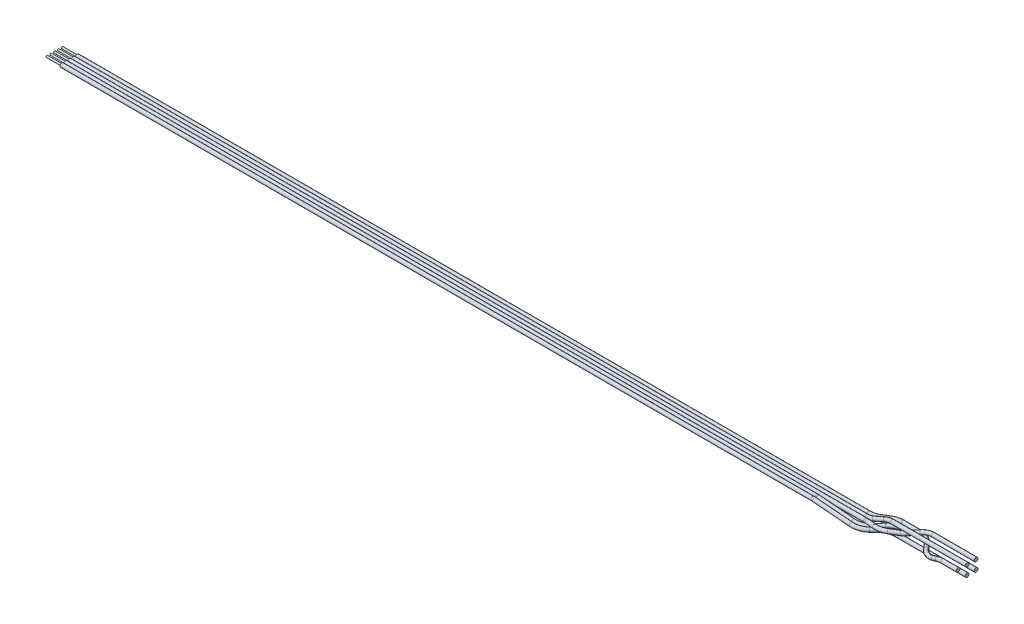
ISO-10303-21;
HEADER;
FILE_DESCRIPTION(('STEP AP214'),'2;1');
FILE_NAME('part.step','',(''),(''),'','','');
FILE_SCHEMA(('AUTOMOTIVE_DESIGN { 1 0 10303 214 1 1 1 1 }'));
ENDSEC;
DATA;
#1=APPLICATION_CONTEXT('core data for automotive mechanical design processes');
#2=APPLICATION_PROTOCOL_DEFINITION('international standard','automotive_design',2000,#1);
#3=PRODUCT_CONTEXT('',#1,'mechanical');
#4=PRODUCT('Part','Part','',(#3));
#5=PRODUCT_RELATED_PRODUCT_CATEGORY('part','',(#4));
#6=PRODUCT_DEFINITION_FORMATION('','',#4);
#7=PRODUCT_DEFINITION_CONTEXT('part definition',#1,'design');
#8=PRODUCT_DEFINITION('design','',#6,#7);
#9=PRODUCT_DEFINITION_SHAPE('','',#8);
#10=(LENGTH_UNIT() NAMED_UNIT(*) SI_UNIT(.MILLI.,.METRE.));
#11=(NAMED_UNIT(*) PLANE_ANGLE_UNIT() SI_UNIT($,.RADIAN.));
#12=(NAMED_UNIT(*) SI_UNIT($,.STERADIAN.) SOLID_ANGLE_UNIT());
#13=UNCERTAINTY_MEASURE_WITH_UNIT(LENGTH_MEASURE(1.E-05),#10,'distance_accuracy_value','');
#14=(GEOMETRIC_REPRESENTATION_CONTEXT(3) GLOBAL_UNCERTAINTY_ASSIGNED_CONTEXT((#13)) GLOBAL_UNIT_ASSIGNED_CONTEXT((#10,
#11,#12)) REPRESENTATION_CONTEXT('',''));
#15=CARTESIAN_POINT('',(0.,0.,0.));
#16=DIRECTION('',(0.,0.,1.));
#17=DIRECTION('',(1.,0.,0.));
#18=AXIS2_PLACEMENT_3D('',#15,#16,#17);
#19=CARTESIAN_POINT('',(296.,1.5,14.43));
#20=DIRECTION('',(1.,0.,0.));
#21=DIRECTION('',(0.,0.,-1.));
#22=AXIS2_PLACEMENT_3D('',#19,#20,#21);
#23=PLANE('',#22);
#24=CARTESIAN_POINT('',(296.,1.5,14.43));
#25=DIRECTION('',(1.,0.,0.));
#26=DIRECTION('',(0.,0.,-1.));
#27=AXIS2_PLACEMENT_3D('',#24,#25,#26);
#28=CIRCLE('',#27,0.6325);
#29=CARTESIAN_POINT('',(296.,1.5,13.7975));
#30=VERTEX_POINT('',#29);
#31=EDGE_CURVE('P0_E17',#30,#30,#28,.F.);
#32=ORIENTED_EDGE('',*,*,#31,.F.);
#33=EDGE_LOOP('',(#32));
#34=FACE_BOUND('',#33,.T.);
#35=ADVANCED_FACE('P0_F14',(#34),#23,.T.);
#36=CARTESIAN_POINT('',(290.8806130178,1.5,14.43));
#37=DIRECTION('',(1.,0.,0.));
#38=DIRECTION('',(0.,0.,-1.));
#39=AXIS2_PLACEMENT_3D('',#36,#37,#38);
#40=CYLINDRICAL_SURFACE('',#39,0.6325);
#41=ORIENTED_EDGE('',*,*,#31,.T.);
#42=EDGE_LOOP('',(#41));
#43=FACE_BOUND('',#42,.T.);
#44=CARTESIAN_POINT('',(290.8806130178,1.5,14.43));
#45=DIRECTION('',(1.,0.,0.));
#46=DIRECTION('',(0.,1.,0.));
#47=AXIS2_PLACEMENT_3D('',#44,#45,#46);
#48=CIRCLE('',#47,0.6325);
#49=CARTESIAN_POINT('',(290.8806130178,2.1325,14.43));
#50=VERTEX_POINT('',#49);
#51=EDGE_CURVE('P0_E29',#50,#50,#48,.F.);
#52=ORIENTED_EDGE('',*,*,#51,.F.);
#53=EDGE_LOOP('',(#52));
#54=FACE_BOUND('',#53,.T.);
#55=ADVANCED_FACE('P0_F94',(#43,#54),#40,.T.);
#56=CARTESIAN_POINT('',(290.8806130178,-4.5,14.43));
#57=DIRECTION('',(0.,0.,-1.));
#58=DIRECTION('',(0.28734788556629,-0.957826285221168,0.));
#59=AXIS2_PLACEMENT_3D('',#56,#57,#58);
#60=TOROIDAL_SURFACE('',#59,6.,0.6325);
#61=ORIENTED_EDGE('',*,*,#51,.T.);
#62=EDGE_LOOP('',(#61));
#63=FACE_BOUND('',#62,.T.);
#64=CARTESIAN_POINT('',(289.156525704404,1.24695771132738,14.43));
#65=DIRECTION('',(0.957826285221168,0.28734788556629,0.));
#66=DIRECTION('',(-0.28734788556629,0.957826285221168,0.));
#67=AXIS2_PLACEMENT_3D('',#64,#65,#66);
#68=CIRCLE('',#67,0.6325);
#69=CARTESIAN_POINT('',(288.974778166783,1.85278283672976,14.43));
#70=VERTEX_POINT('',#69);
#71=EDGE_CURVE('P0_E97',#70,#70,#68,.F.);
#72=ORIENTED_EDGE('',*,*,#71,.F.);
#73=EDGE_LOOP('',(#72));
#74=FACE_BOUND('',#73,.T.);
#75=ADVANCED_FACE('P0_F91',(#63,#74),#60,.T.);
#76=CARTESIAN_POINT('',(287.814150096,0.8442450288062,14.43));
#77=DIRECTION('',(0.957826285221168,0.28734788556629,0.));
#78=DIRECTION('',(-0.28734788556629,0.957826285221168,0.));
#79=AXIS2_PLACEMENT_3D('',#76,#77,#78);
#80=CYLINDRICAL_SURFACE('',#79,0.6325);
#81=ORIENTED_EDGE('',*,*,#71,.T.);
#82=EDGE_LOOP('',(#81));
#83=FACE_BOUND('',#82,.T.);
#84=CARTESIAN_POINT('',(287.814150096004,0.844245028791019,14.4300000000002));
#85=DIRECTION('',(0.95782628522173,0.287347885564419,8.44208036809846E-12));
#86=DIRECTION('',(0.0669156263339376,-0.223052087810011,0.972507102840865));
#87=AXIS2_PLACEMENT_3D('',#84,#85,#86);
#88=CIRCLE('',#87,0.6325);
#89=CARTESIAN_POINT('',(287.85647422966,0.703164583251187,15.045110742547));
#90=VERTEX_POINT('',#89);
#91=EDGE_CURVE('P0_E80',#90,#90,#88,.F.);
#92=ORIENTED_EDGE('',*,*,#91,.F.);
#93=EDGE_LOOP('',(#92));
#94=FACE_BOUND('',#93,.T.);
#95=ADVANCED_FACE('P0_F87',(#83,#94),#80,.T.);
#96=CARTESIAN_POINT('',(287.412656338,2.182557555651,8.594957382955));
#97=DIRECTION('',(-0.279447859699584,0.931492865665248,0.232873216416287));
#98=DIRECTION('',(0.715592641197166,0.36375959260856,-0.596327200997673));
#99=AXIS2_PLACEMENT_3D('',#96,#97,#98);
#100=TOROIDAL_SURFACE('',#99,6.,0.6325);
#101=ORIENTED_EDGE('',*,*,#91,.T.);
#102=EDGE_LOOP('',(#101));
#103=FACE_BOUND('',#102,.T.);
#104=CARTESIAN_POINT('',(283.119100490785,0.,12.1729205889123));
#105=DIRECTION('',(0.64018439966448,0.,0.768221279597376));
#106=DIRECTION('',(0.768221279597376,0.,-0.64018439966448));
#107=AXIS2_PLACEMENT_3D('',#104,#105,#106);
#108=CIRCLE('',#107,0.6325);
#109=CARTESIAN_POINT('',(283.605000450131,0.,11.7680039561245));
#110=VERTEX_POINT('',#109);
#111=EDGE_CURVE('P0_E77',#110,#110,#108,.F.);
#112=ORIENTED_EDGE('',*,*,#111,.F.);
#113=EDGE_LOOP('',(#112));
#114=FACE_BOUND('',#113,.T.);
#115=ADVANCED_FACE('P0_F84',(#103,#114),#100,.T.);
#116=CARTESIAN_POINT('',(281.7990780017,0.,10.58889360201));
#117=DIRECTION('',(0.64018439966448,0.,0.768221279597376));
#118=DIRECTION('',(0.768221279597376,0.,-0.64018439966448));
#119=AXIS2_PLACEMENT_3D('',#116,#117,#118);
#120=CYLINDRICAL_SURFACE('',#119,0.6325);
#121=ORIENTED_EDGE('',*,*,#111,.T.);
#122=EDGE_LOOP('',(#121));
#123=FACE_BOUND('',#122,.T.);
#124=CARTESIAN_POINT('',(281.799078001675,0.,10.5888936020025));
#125=DIRECTION('',(0.640184399666259,0.,0.768221279595894));
#126=DIRECTION('',(0.768221279595894,0.,-0.640184399666259));
#127=AXIS2_PLACEMENT_3D('',#124,#125,#126);
#128=CIRCLE('',#127,0.6325);
#129=CARTESIAN_POINT('',(282.28497796102,0.,10.1839769692136));
#130=VERTEX_POINT('',#129);
#131=EDGE_CURVE('P0_E74',#130,#130,#128,.F.);
#132=ORIENTED_EDGE('',*,*,#131,.F.);
#133=EDGE_LOOP('',(#132));
#134=FACE_BOUND('',#133,.T.);
#135=ADVANCED_FACE('P0_F68',(#123,#134),#120,.T.);
#136=CARTESIAN_POINT('',(277.1897503241,0.,14.43));
#137=DIRECTION('',(0.,-1.,0.));
#138=DIRECTION('',(0.,0.,1.));
#139=AXIS2_PLACEMENT_3D('',#136,#137,#138);
#140=TOROIDAL_SURFACE('',#139,6.,0.6325);
#141=ORIENTED_EDGE('',*,*,#131,.T.);
#142=EDGE_LOOP('',(#141));
#143=FACE_BOUND('',#142,.T.);
#144=CARTESIAN_POINT('',(277.1897503241,0.,8.43));
#145=DIRECTION('',(1.,0.,0.));
#146=DIRECTION('',(0.,0.,-1.));
#147=AXIS2_PLACEMENT_3D('',#144,#145,#146);
#148=CIRCLE('',#147,0.6325);
#149=CARTESIAN_POINT('',(277.1897503241,0.,7.7975));
#150=VERTEX_POINT('',#149);
#151=EDGE_CURVE('P0_E73',#150,#150,#148,.F.);
#152=ORIENTED_EDGE('',*,*,#151,.F.);
#153=EDGE_LOOP('',(#152));
#154=FACE_BOUND('',#153,.T.);
#155=ADVANCED_FACE('P0_F63',(#143,#154),#140,.T.);
#156=CARTESIAN_POINT('',(271.6619037897,0.,8.43));
#157=DIRECTION('',(1.,0.,0.));
#158=DIRECTION('',(0.,0.,-1.));
#159=AXIS2_PLACEMENT_3D('',#156,#157,#158);
#160=CYLINDRICAL_SURFACE('',#159,0.6325);
#161=ORIENTED_EDGE('',*,*,#151,.T.);
#162=EDGE_LOOP('',(#161));
#163=FACE_BOUND('',#162,.T.);
#164=CARTESIAN_POINT('',(271.6619037897,0.,8.42999999999999));
#165=DIRECTION('',(1.,0.,0.));
#166=DIRECTION('',(0.,0.,-1.));
#167=AXIS2_PLACEMENT_3D('',#164,#165,#166);
#168=CIRCLE('',#167,0.6325);
#169=CARTESIAN_POINT('',(271.6619037897,0.,7.79749999999999));
#170=VERTEX_POINT('',#169);
#171=EDGE_CURVE('P0_E44',#170,#170,#168,.F.);
#172=ORIENTED_EDGE('',*,*,#171,.F.);
#173=EDGE_LOOP('',(#172));
#174=FACE_BOUND('',#173,.T.);
#175=ADVANCED_FACE('P0_F58',(#163,#174),#160,.T.);
#176=CARTESIAN_POINT('',(271.6619037897,0.,14.43));
#177=DIRECTION('',(0.,-1.,0.));
#178=DIRECTION('',(0.514495755427529,0.,0.857492925712543));
#179=AXIS2_PLACEMENT_3D('',#176,#177,#178);
#180=TOROIDAL_SURFACE('',#179,6.00000000000001,0.6325);
#181=ORIENTED_EDGE('',*,*,#171,.T.);
#182=EDGE_LOOP('',(#181));
#183=FACE_BOUND('',#182,.T.);
#184=CARTESIAN_POINT('',(268.574929257121,0.,9.28504244574728));
#185=DIRECTION('',(0.857492925712544,0.,-0.514495755427527));
#186=DIRECTION('',(-0.514495755427527,0.,-0.857492925712544));
#187=AXIS2_PLACEMENT_3D('',#184,#185,#186);
#188=CIRCLE('',#187,0.6325);
#189=CARTESIAN_POINT('',(268.249510691813,0.,8.74267817023409));
#190=VERTEX_POINT('',#189);
#191=EDGE_CURVE('P0_E39',#190,#190,#188,.F.);
#192=ORIENTED_EDGE('',*,*,#191,.F.);
#193=EDGE_LOOP('',(#192));
#194=FACE_BOUND('',#193,.T.);
#195=ADVANCED_FACE('P0_F53',(#183,#194),#180,.T.);
#196=CARTESIAN_POINT('',(266.4250707429,0.,10.57495755428));
#197=DIRECTION('',(0.857492925712544,0.,-0.514495755427527));
#198=DIRECTION('',(-0.514495755427527,0.,-0.857492925712544));
#199=AXIS2_PLACEMENT_3D('',#196,#197,#198);
#200=CYLINDRICAL_SURFACE('',#199,0.6325);
#201=ORIENTED_EDGE('',*,*,#191,.T.);
#202=EDGE_LOOP('',(#201));
#203=FACE_BOUND('',#202,.T.);
#204=CARTESIAN_POINT('',(266.425070742901,0.,10.5749575542536));
#205=DIRECTION('',(0.857492925708929,0.,-0.514495755433552));
#206=DIRECTION('',(0.514495755433552,0.,0.857492925708929));
#207=AXIS2_PLACEMENT_3D('',#204,#205,#206);
#208=CIRCLE('',#207,0.6325);
#209=CARTESIAN_POINT('',(266.750489308213,0.,11.1173218297645));
#210=VERTEX_POINT('',#209);
#211=EDGE_CURVE('P0_E33',#210,#210,#208,.F.);
#212=ORIENTED_EDGE('',*,*,#211,.F.);
#213=EDGE_LOOP('',(#212));
#214=FACE_BOUND('',#213,.T.);
#215=ADVANCED_FACE('P0_F57',(#203,#214),#200,.T.);
#216=CARTESIAN_POINT('',(-5.,0.,-5.08));
#217=DIRECTION('',(-1.,0.,0.));
#218=DIRECTION('',(0.,0.,1.));
#219=AXIS2_PLACEMENT_3D('',#216,#217,#218);
#220=PLANE('',#219);
#221=CARTESIAN_POINT('',(-5.,0.,11.43));
#222=DIRECTION('',(-1.,0.,0.));
#223=DIRECTION('',(0.,0.,1.));
#224=AXIS2_PLACEMENT_3D('',#221,#222,#223);
#225=CIRCLE('',#224,0.3);
#226=CARTESIAN_POINT('',(-5.,0.,11.73));
#227=VERTEX_POINT('',#226);
#228=EDGE_CURVE('P0_E31',#227,#227,#225,.F.);
#229=ORIENTED_EDGE('',*,*,#228,.F.);
#230=EDGE_LOOP('',(#229));
#231=FACE_BOUND('',#230,.T.);
#232=ADVANCED_FACE('P0_F129',(#231),#220,.T.);
#233=CARTESIAN_POINT('',(263.3380962103,0.,5.43));
#234=DIRECTION('',(0.,1.,0.));
#235=DIRECTION('',(0.,0.,-1.));
#236=AXIS2_PLACEMENT_3D('',#233,#234,#235);
#237=TOROIDAL_SURFACE('',#236,6.,0.6325);
#238=ORIENTED_EDGE('',*,*,#211,.T.);
#239=EDGE_LOOP('',(#238));
#240=FACE_BOUND('',#239,.T.);
#241=CARTESIAN_POINT('',(263.3380962103,0.,11.43));
#242=DIRECTION('',(1.,0.,0.));
#243=DIRECTION('',(0.,0.,-1.));
#244=AXIS2_PLACEMENT_3D('',#241,#242,#243);
#245=CIRCLE('',#244,0.6325);
#246=CARTESIAN_POINT('',(263.3380962103,0.,10.7975));
#247=VERTEX_POINT('',#246);
#248=EDGE_CURVE('P0_E26',#247,#247,#245,.F.);
#249=ORIENTED_EDGE('',*,*,#248,.F.);
#250=EDGE_LOOP('',(#249));
#251=FACE_BOUND('',#250,.T.);
#252=ADVANCED_FACE('P0_F127',(#240,#251),#237,.T.);
#253=CARTESIAN_POINT('',(0.,0.,11.43));
#254=DIRECTION('',(-1.,0.,0.));
#255=DIRECTION('',(0.,0.,1.));
#256=AXIS2_PLACEMENT_3D('',#253,#254,#255);
#257=CYLINDRICAL_SURFACE('',#256,0.3);
#258=ORIENTED_EDGE('',*,*,#228,.T.);
#259=EDGE_LOOP('',(#258));
#260=FACE_BOUND('',#259,.T.);
#261=CARTESIAN_POINT('',(0.,0.,11.43));
#262=DIRECTION('',(-1.,0.,0.));
#263=DIRECTION('',(0.,0.,1.));
#264=AXIS2_PLACEMENT_3D('',#261,#262,#263);
#265=CIRCLE('',#264,0.3);
#266=CARTESIAN_POINT('',(0.,0.,11.73));
#267=VERTEX_POINT('',#266);
#268=EDGE_CURVE('P0_E21',#267,#267,#265,.T.);
#269=ORIENTED_EDGE('',*,*,#268,.T.);
#270=EDGE_LOOP('',(#269));
#271=FACE_BOUND('',#270,.T.);
#272=ADVANCED_FACE('P0_F121',(#260,#271),#257,.T.);
#273=CARTESIAN_POINT('',(0.,0.,11.43));
#274=DIRECTION('',(1.,0.,0.));
#275=DIRECTION('',(0.,0.,-1.));
#276=AXIS2_PLACEMENT_3D('',#273,#274,#275);
#277=PLANE('',#276);
#278=ORIENTED_EDGE('',*,*,#268,.F.);
#279=EDGE_LOOP('',(#278));
#280=FACE_BOUND('',#279,.T.);
#281=CARTESIAN_POINT('',(0.,0.,11.43));
#282=DIRECTION('',(1.,0.,0.));
#283=DIRECTION('',(0.,0.,-1.));
#284=AXIS2_PLACEMENT_3D('',#281,#282,#283);
#285=CIRCLE('',#284,0.6325);
#286=CARTESIAN_POINT('',(0.,0.,10.7975));
#287=VERTEX_POINT('',#286);
#288=EDGE_CURVE('P0_E10',#287,#287,#285,.T.);
#289=ORIENTED_EDGE('',*,*,#288,.F.);
#290=EDGE_LOOP('',(#289));
#291=FACE_BOUND('',#290,.T.);
#292=ADVANCED_FACE('P0_F115',(#280,#291),#277,.F.);
#293=CARTESIAN_POINT('',(0.,0.,11.43));
#294=DIRECTION('',(1.,0.,0.));
#295=DIRECTION('',(0.,0.,-1.));
#296=AXIS2_PLACEMENT_3D('',#293,#294,#295);
#297=CYLINDRICAL_SURFACE('',#296,0.6325);
#298=ORIENTED_EDGE('',*,*,#248,.T.);
#299=EDGE_LOOP('',(#298));
#300=FACE_BOUND('',#299,.T.);
#301=ORIENTED_EDGE('',*,*,#288,.T.);
#302=EDGE_LOOP('',(#301));
#303=FACE_BOUND('',#302,.T.);
#304=ADVANCED_FACE('P0_F113',(#300,#303),#297,.T.);
#305=CLOSED_SHELL('',(#35,#55,#75,#95,#115,#135,#155,#175,#195,#215,#232,#252,#272,#292,#304));
#306=MANIFOLD_SOLID_BREP('P0_B1',#305);
#307=CARTESIAN_POINT('',(296.,1.5,8.43));
#308=DIRECTION('',(1.,0.,0.));
#309=DIRECTION('',(0.,0.,-1.));
#310=AXIS2_PLACEMENT_3D('',#307,#308,#309);
#311=PLANE('',#310);
#312=CARTESIAN_POINT('',(296.,1.5,8.43));
#313=DIRECTION('',(1.,0.,0.));
#314=DIRECTION('',(0.,0.,-1.));
#315=AXIS2_PLACEMENT_3D('',#312,#313,#314);
#316=CIRCLE('',#315,0.6325);
#317=CARTESIAN_POINT('',(296.,1.5,7.7975));
#318=VERTEX_POINT('',#317);
#319=EDGE_CURVE('P1_E17',#318,#318,#316,.F.);
#320=ORIENTED_EDGE('',*,*,#319,.F.);
#321=EDGE_LOOP('',(#320));
#322=FACE_BOUND('',#321,.T.);
#323=ADVANCED_FACE('P1_F14',(#322),#311,.T.);
#324=CARTESIAN_POINT('',(281.8260577043,1.5,8.43));
#325=DIRECTION('',(1.,0.,0.));
#326=DIRECTION('',(0.,0.,-1.));
#327=AXIS2_PLACEMENT_3D('',#324,#325,#326);
#328=CYLINDRICAL_SURFACE('',#327,0.6325);
#329=ORIENTED_EDGE('',*,*,#319,.T.);
#330=EDGE_LOOP('',(#329));
#331=FACE_BOUND('',#330,.T.);
#332=CARTESIAN_POINT('',(281.8260577043,1.5,8.43000000000063));
#333=DIRECTION('',(1.,0.,0.));
#334=DIRECTION('',(0.,0.447213595499997,-0.894427190999896));
#335=AXIS2_PLACEMENT_3D('',#332,#333,#334);
#336=CIRCLE('',#335,0.6325);
#337=CARTESIAN_POINT('',(281.8260577043,1.78286259915375,7.8642748016932));
#338=VERTEX_POINT('',#337);
#339=EDGE_CURVE('P1_E29',#338,#338,#336,.F.);
#340=ORIENTED_EDGE('',*,*,#339,.F.);
#341=EDGE_LOOP('',(#340));
#342=FACE_BOUND('',#341,.T.);
#343=ADVANCED_FACE('P1_F82',(#331,#342),#328,.T.);
#344=CARTESIAN_POINT('',(281.8260577043,-1.183281573,13.796563146));
#345=DIRECTION('',(0.,-0.894427190999896,-0.447213595499998));
#346=DIRECTION('',(0.557086014531193,-0.371390676354126,0.742781352708168));
#347=AXIS2_PLACEMENT_3D('',#344,#345,#346);
#348=TOROIDAL_SURFACE('',#347,6.00000000000001,0.6325);
#349=ORIENTED_EDGE('',*,*,#339,.T.);
#350=EDGE_LOOP('',(#349));
#351=FACE_BOUND('',#350,.T.);
#352=CARTESIAN_POINT('',(278.483541617079,1.04506248513558,9.33987502973284));
#353=DIRECTION('',(0.83045479853742,0.249136439561206,-0.498272879122412));
#354=DIRECTION('',(-0.514495755427496,0.,-0.857492925712562));
#355=AXIS2_PLACEMENT_3D('',#352,#353,#354);
#356=CIRCLE('',#355,0.6325);
#357=CARTESIAN_POINT('',(278.158123051771,1.04506248513558,8.79751075421964));
#358=VERTEX_POINT('',#357);
#359=EDGE_CURVE('P1_E77',#358,#358,#356,.F.);
#360=ORIENTED_EDGE('',*,*,#359,.F.);
#361=EDGE_LOOP('',(#360));
#362=FACE_BOUND('',#361,.T.);
#363=ADVANCED_FACE('P1_F80',(#351,#362),#348,.T.);
#364=CARTESIAN_POINT('',(275.6306320755,0.189189622662,11.05162075468));
#365=DIRECTION('',(0.83045479853742,0.249136439561206,-0.498272879122412));
#366=DIRECTION('',(-0.514495755427496,0.,-0.857492925712562));
#367=AXIS2_PLACEMENT_3D('',#364,#365,#366);
#368=CYLINDRICAL_SURFACE('',#367,0.6325);
#369=ORIENTED_EDGE('',*,*,#359,.T.);
#370=EDGE_LOOP('',(#369));
#371=FACE_BOUND('',#370,.T.);
#372=CARTESIAN_POINT('',(275.630632075517,0.189189622647204,11.0516207547102));
#373=DIRECTION('',(0.830454798539507,0.249136439551656,-0.49827287912371));
#374=DIRECTION('',(0.213632734452766,-0.968468396225465,-0.128179640671633));
#375=AXIS2_PLACEMENT_3D('',#372,#373,#374);
#376=CIRCLE('',#375,0.6325);
#377=CARTESIAN_POINT('',(275.765754780058,-0.423366637965403,10.9705471319854));
#378=VERTEX_POINT('',#377);
#379=EDGE_CURVE('P1_E74',#378,#378,#376,.F.);
#380=ORIENTED_EDGE('',*,*,#379,.F.);
#381=EDGE_LOOP('',(#380));
#382=FACE_BOUND('',#381,.T.);
#383=ADVANCED_FACE('P1_F68',(#371,#382),#368,.T.);
#384=CARTESIAN_POINT('',(274.3488356688,6.,11.82069859874));
#385=DIRECTION('',(0.514495755427527,0.,0.857492925712544));
#386=DIRECTION('',(0.,1.,0.));
#387=AXIS2_PLACEMENT_3D('',#384,#385,#386);
#388=TOROIDAL_SURFACE('',#387,6.,0.6325);
#389=ORIENTED_EDGE('',*,*,#379,.T.);
#390=EDGE_LOOP('',(#389));
#391=FACE_BOUND('',#390,.T.);
#392=CARTESIAN_POINT('',(274.348835668782,0.,11.8206985987206));
#393=DIRECTION('',(0.857492925712544,0.,-0.514495755427527));
#394=DIRECTION('',(-0.514495755427527,0.,-0.857492925712544));
#395=AXIS2_PLACEMENT_3D('',#392,#393,#394);
#396=CIRCLE('',#395,0.6325);
#397=CARTESIAN_POINT('',(274.023417103474,0.,11.2783343232074));
#398=VERTEX_POINT('',#397);
#399=EDGE_CURVE('P1_E73',#398,#398,#396,.F.);
#400=ORIENTED_EDGE('',*,*,#399,.F.);
#401=EDGE_LOOP('',(#400));
#402=FACE_BOUND('',#401,.T.);
#403=ADVANCED_FACE('P1_F63',(#391,#402),#388,.T.);
#404=CARTESIAN_POINT('',(271.6826338142,0.,13.42041971147));
#405=DIRECTION('',(0.857492925712544,0.,-0.514495755427527));
#406=DIRECTION('',(-0.514495755427527,0.,-0.857492925712544));
#407=AXIS2_PLACEMENT_3D('',#404,#405,#406);
#408=CYLINDRICAL_SURFACE('',#407,0.6325);
#409=ORIENTED_EDGE('',*,*,#399,.T.);
#410=EDGE_LOOP('',(#409));
#411=FACE_BOUND('',#410,.T.);
#412=CARTESIAN_POINT('',(271.682633814185,0.,13.4204197114595));
#413=DIRECTION('',(0.857492925710575,0.,-0.514495755430808));
#414=DIRECTION('',(0.514495755430799,0.,0.85749292571058));
#415=AXIS2_PLACEMENT_3D('',#412,#413,#414);
#416=CIRCLE('',#415,0.6325);
#417=CARTESIAN_POINT('',(272.008052379495,0.,13.9627839869714));
#418=VERTEX_POINT('',#417);
#419=EDGE_CURVE('P1_E44',#418,#418,#416,.F.);
#420=ORIENTED_EDGE('',*,*,#419,.F.);
#421=EDGE_LOOP('',(#420));
#422=FACE_BOUND('',#421,.T.);
#423=ADVANCED_FACE('P1_F58',(#411,#422),#408,.T.);
#424=CARTESIAN_POINT('',(268.5956592816,0.,8.275462157196));
#425=DIRECTION('',(0.,1.,0.));
#426=DIRECTION('',(0.0916131102511412,0.,-0.995794676642787));
#427=AXIS2_PLACEMENT_3D('',#424,#425,#426);
#428=TOROIDAL_SURFACE('',#427,6.,0.6325);
#429=ORIENTED_EDGE('',*,*,#419,.T.);
#430=EDGE_LOOP('',(#429));
#431=FACE_BOUND('',#430,.T.);
#432=CARTESIAN_POINT('',(268.045980620134,0.,14.2502302170535));
#433=DIRECTION('',(0.995794676642787,0.,0.0916131102511388));
#434=DIRECTION('',(0.0916131102511388,0.,-0.995794676642787));
#435=AXIS2_PLACEMENT_3D('',#432,#433,#434);
#436=CIRCLE('',#435,0.6325);
#437=CARTESIAN_POINT('',(268.103925912368,0.,13.620390084077));
#438=VERTEX_POINT('',#437);
#439=EDGE_CURVE('P1_E39',#438,#438,#436,.F.);
#440=ORIENTED_EDGE('',*,*,#439,.F.);
#441=EDGE_LOOP('',(#440));
#442=FACE_BOUND('',#441,.T.);
#443=ADVANCED_FACE('P1_F53',(#431,#442),#428,.T.);
#444=CARTESIAN_POINT('',(265.2742602189,0.,13.99523194014));
#445=DIRECTION('',(0.995794676642787,0.,0.0916131102511388));
#446=DIRECTION('',(0.0916131102511388,0.,-0.995794676642787));
#447=AXIS2_PLACEMENT_3D('',#444,#445,#446);
#448=CYLINDRICAL_SURFACE('',#447,0.6325);
#449=ORIENTED_EDGE('',*,*,#439,.T.);
#450=EDGE_LOOP('',(#449));
#451=FACE_BOUND('',#450,.T.);
#452=CARTESIAN_POINT('',(265.274260218937,0.,13.995231940146));
#453=DIRECTION('',(0.995794676642327,0.,0.0916131102561369));
#454=DIRECTION('',(0.0916131102561369,0.,-0.995794676642327));
#455=AXIS2_PLACEMENT_3D('',#452,#453,#454);
#456=CIRCLE('',#455,0.6325);
#457=CARTESIAN_POINT('',(265.332205511174,0.,13.3653918071698));
#458=VERTEX_POINT('',#457);
#459=EDGE_CURVE('P1_E33',#458,#458,#456,.F.);
#460=ORIENTED_EDGE('',*,*,#459,.F.);
#461=EDGE_LOOP('',(#460));
#462=FACE_BOUND('',#461,.T.);
#463=ADVANCED_FACE('P1_F57',(#451,#462),#448,.T.);
#464=CARTESIAN_POINT('',(-5.,0.,-2.54));
#465=DIRECTION('',(-1.,0.,0.));
#466=DIRECTION('',(0.,0.,1.));
#467=AXIS2_PLACEMENT_3D('',#464,#465,#466);
#468=PLANE('',#467);
#469=CARTESIAN_POINT('',(-5.,0.,13.97));
#470=DIRECTION('',(-1.,0.,0.));
#471=DIRECTION('',(0.,0.,1.));
#472=AXIS2_PLACEMENT_3D('',#469,#470,#471);
#473=CIRCLE('',#472,0.3);
#474=CARTESIAN_POINT('',(-5.,0.,14.27));
#475=VERTEX_POINT('',#474);
#476=EDGE_CURVE('P1_E31',#475,#475,#473,.F.);
#477=ORIENTED_EDGE('',*,*,#476,.F.);
#478=EDGE_LOOP('',(#477));
#479=FACE_BOUND('',#478,.T.);
#480=ADVANCED_FACE('P1_F109',(#479),#468,.T.);
#481=CARTESIAN_POINT('',(264.7245815574,0.,19.97));
#482=DIRECTION('',(0.,-1.,0.));
#483=DIRECTION('',(0.,0.,1.));
#484=AXIS2_PLACEMENT_3D('',#481,#482,#483);
#485=TOROIDAL_SURFACE('',#484,6.,0.6325);
#486=ORIENTED_EDGE('',*,*,#459,.T.);
#487=EDGE_LOOP('',(#486));
#488=FACE_BOUND('',#487,.T.);
#489=CARTESIAN_POINT('',(264.7245815574,0.,13.97));
#490=DIRECTION('',(1.,0.,0.));
#491=DIRECTION('',(0.,0.,-1.));
#492=AXIS2_PLACEMENT_3D('',#489,#490,#491);
#493=CIRCLE('',#492,0.6325);
#494=CARTESIAN_POINT('',(264.7245815574,0.,13.3375));
#495=VERTEX_POINT('',#494);
#496=EDGE_CURVE('P1_E26',#495,#495,#493,.F.);
#497=ORIENTED_EDGE('',*,*,#496,.F.);
#498=EDGE_LOOP('',(#497));
#499=FACE_BOUND('',#498,.T.);
#500=ADVANCED_FACE('P1_F107',(#488,#499),#485,.T.);
#501=CARTESIAN_POINT('',(0.,0.,13.97));
#502=DIRECTION('',(-1.,0.,0.));
#503=DIRECTION('',(0.,0.,1.));
#504=AXIS2_PLACEMENT_3D('',#501,#502,#503);
#505=CYLINDRICAL_SURFACE('',#504,0.3);
#506=ORIENTED_EDGE('',*,*,#476,.T.);
#507=EDGE_LOOP('',(#506));
#508=FACE_BOUND('',#507,.T.);
#509=CARTESIAN_POINT('',(0.,0.,13.97));
#510=DIRECTION('',(-1.,0.,0.));
#511=DIRECTION('',(0.,0.,1.));
#512=AXIS2_PLACEMENT_3D('',#509,#510,#511);
#513=CIRCLE('',#512,0.3);
#514=CARTESIAN_POINT('',(0.,0.,14.27));
#515=VERTEX_POINT('',#514);
#516=EDGE_CURVE('P1_E21',#515,#515,#513,.T.);
#517=ORIENTED_EDGE('',*,*,#516,.T.);
#518=EDGE_LOOP('',(#517));
#519=FACE_BOUND('',#518,.T.);
#520=ADVANCED_FACE('P1_F101',(#508,#519),#505,.T.);
#521=CARTESIAN_POINT('',(0.,0.,13.97));
#522=DIRECTION('',(1.,0.,0.));
#523=DIRECTION('',(0.,0.,-1.));
#524=AXIS2_PLACEMENT_3D('',#521,#522,#523);
#525=PLANE('',#524);
#526=ORIENTED_EDGE('',*,*,#516,.F.);
#527=EDGE_LOOP('',(#526));
#528=FACE_BOUND('',#527,.T.);
#529=CARTESIAN_POINT('',(0.,0.,13.97));
#530=DIRECTION('',(1.,0.,0.));
#531=DIRECTION('',(0.,0.,-1.));
#532=AXIS2_PLACEMENT_3D('',#529,#530,#531);
#533=CIRCLE('',#532,0.6325);
#534=CARTESIAN_POINT('',(0.,0.,13.3375));
#535=VERTEX_POINT('',#534);
#536=EDGE_CURVE('P1_E10',#535,#535,#533,.T.);
#537=ORIENTED_EDGE('',*,*,#536,.F.);
#538=EDGE_LOOP('',(#537));
#539=FACE_BOUND('',#538,.T.);
#540=ADVANCED_FACE('P1_F95',(#528,#539),#525,.F.);
#541=CARTESIAN_POINT('',(0.,0.,13.97));
#542=DIRECTION('',(1.,0.,0.));
#543=DIRECTION('',(0.,0.,-1.));
#544=AXIS2_PLACEMENT_3D('',#541,#542,#543);
#545=CYLINDRICAL_SURFACE('',#544,0.6325);
#546=ORIENTED_EDGE('',*,*,#496,.T.);
#547=EDGE_LOOP('',(#546));
#548=FACE_BOUND('',#547,.T.);
#549=ORIENTED_EDGE('',*,*,#536,.T.);
#550=EDGE_LOOP('',(#549));
#551=FACE_BOUND('',#550,.T.);
#552=ADVANCED_FACE('P1_F93',(#548,#551),#545,.T.);
#553=CLOSED_SHELL('',(#323,#343,#363,#383,#403,#423,#443,#463,#480,#500,#520,#540,#552));
#554=MANIFOLD_SOLID_BREP('P1_B1',#553);
#555=CARTESIAN_POINT('',(296.,-1.5,11.43));
#556=DIRECTION('',(1.,0.,0.));
#557=DIRECTION('',(0.,0.,-1.));
#558=AXIS2_PLACEMENT_3D('',#555,#556,#557);
#559=PLANE('',#558);
#560=CARTESIAN_POINT('',(296.,-1.5,11.43));
#561=DIRECTION('',(1.,0.,0.));
#562=DIRECTION('',(0.,0.,-1.));
#563=AXIS2_PLACEMENT_3D('',#560,#561,#562);
#564=CIRCLE('',#563,0.6325);
#565=CARTESIAN_POINT('',(296.,-1.5,10.7975));
#566=VERTEX_POINT('',#565);
#567=EDGE_CURVE('P2_E17',#566,#566,#564,.F.);
#568=ORIENTED_EDGE('',*,*,#567,.F.);
#569=EDGE_LOOP('',(#568));
#570=FACE_BOUND('',#569,.T.);
#571=ADVANCED_FACE('P2_F14',(#570),#559,.T.);
#572=CARTESIAN_POINT('',(272.5150267046,-1.5,11.43));
#573=DIRECTION('',(1.,0.,0.));
#574=DIRECTION('',(0.,0.,-1.));
#575=AXIS2_PLACEMENT_3D('',#572,#573,#574);
#576=CYLINDRICAL_SURFACE('',#575,0.6325);
#577=ORIENTED_EDGE('',*,*,#567,.T.);
#578=EDGE_LOOP('',(#577));
#579=FACE_BOUND('',#578,.T.);
#580=CARTESIAN_POINT('',(272.5150267046,-1.50000000000026,11.4300000000011));
#581=DIRECTION('',(1.,0.,0.));
#582=DIRECTION('',(0.,-0.0452292570292105,-0.998976633514811));
#583=AXIS2_PLACEMENT_3D('',#580,#581,#582);
#584=CIRCLE('',#583,0.6325);
#585=CARTESIAN_POINT('',(272.5150267046,-1.52860750507124,10.798147279303));
#586=VERTEX_POINT('',#585);
#587=EDGE_CURVE('P2_E30',#586,#586,#584,.F.);
#588=ORIENTED_EDGE('',*,*,#587,.F.);
#589=EDGE_LOOP('',(#588));
#590=FACE_BOUND('',#589,.T.);
#591=ADVANCED_FACE('P2_F67',(#579,#590),#576,.T.);
#592=CARTESIAN_POINT('',(272.5150267046,-1.228624457825,17.42385980109));
#593=DIRECTION('',(0.,-0.998976633514811,0.0452292570292105));
#594=DIRECTION('',(0.713055268430868,0.031710586082974,0.700390336093565));
#595=AXIS2_PLACEMENT_3D('',#592,#593,#594);
#596=TOROIDAL_SURFACE('',#595,6.00000000000002,0.6325);
#597=ORIENTED_EDGE('',*,*,#587,.T.);
#598=EDGE_LOOP('',(#597));
#599=FACE_BOUND('',#598,.T.);
#600=CARTESIAN_POINT('',(268.236695093987,-1.41888797432243,13.2215177845208));
#601=DIRECTION('',(0.701107826345509,-0.0322509600119004,-0.712325551567109));
#602=DIRECTION('',(-0.712696294407391,0.,-0.701472730715865));
#603=AXIS2_PLACEMENT_3D('',#600,#601,#602);
#604=CIRCLE('',#603,0.6325);
#605=CARTESIAN_POINT('',(267.785914687775,-1.41888797432243,12.777836282343));
#606=VERTEX_POINT('',#605);
#607=EDGE_CURVE('P2_E47',#606,#606,#604,.F.);
#608=ORIENTED_EDGE('',*,*,#607,.F.);
#609=EDGE_LOOP('',(#608));
#610=FACE_BOUND('',#609,.T.);
#611=ADVANCED_FACE('P2_F64',(#599,#610),#596,.T.);
#612=CARTESIAN_POINT('',(266.762537192,-1.351076710831,14.71926221294));
#613=DIRECTION('',(0.701107826345509,-0.0322509600119004,-0.712325551567109));
#614=DIRECTION('',(-0.712696294407391,0.,-0.701472730715865));
#615=AXIS2_PLACEMENT_3D('',#612,#613,#614);
#616=CYLINDRICAL_SURFACE('',#615,0.6325);
#617=ORIENTED_EDGE('',*,*,#607,.T.);
#618=EDGE_LOOP('',(#617));
#619=FACE_BOUND('',#618,.T.);
#620=CARTESIAN_POINT('',(266.762537192013,-1.35107671083048,14.7192622129663));
#621=DIRECTION('',(0.701107826349004,-0.0322509600123157,-0.71232555156365));
#622=DIRECTION('',(0.708054103152187,-0.0866204148846087,0.700825435279408));
#623=AXIS2_PLACEMENT_3D('',#620,#621,#622);
#624=CIRCLE('',#623,0.6325);
#625=CARTESIAN_POINT('',(267.210381412257,-1.40586412324499,15.1625343007805));
#626=VERTEX_POINT('',#625);
#627=EDGE_CURVE('P2_E42',#626,#626,#624,.F.);
#628=ORIENTED_EDGE('',*,*,#627,.F.);
#629=EDGE_LOOP('',(#628));
#630=FACE_BOUND('',#629,.T.);
#631=ADVANCED_FACE('P2_F59',(#619,#630),#616,.T.);
#632=CARTESIAN_POINT('',(262.5142125731,-0.831354221522802,10.51430960129));
#633=DIRECTION('',(0.0843042278981623,0.995719227143627,0.037894826229881));
#634=DIRECTION('',(0.00319699035893538,0.0377597286488893,-0.999281733118847));
#635=AXIS2_PLACEMENT_3D('',#632,#633,#634);
#636=TOROIDAL_SURFACE('',#635,6.,0.6325);
#637=ORIENTED_EDGE('',*,*,#627,.T.);
#638=EDGE_LOOP('',(#637));
#639=FACE_BOUND('',#638,.T.);
#640=CARTESIAN_POINT('',(262.495030630894,-1.05791259341697,16.51));
#641=DIRECTION('',(0.99643493335548,-0.0843648243574283,0.));
#642=DIRECTION('',(0.0843648243574283,0.99643493335548,0.));
#643=AXIS2_PLACEMENT_3D('',#640,#641,#642);
#644=CIRCLE('',#643,0.6325);
#645=CARTESIAN_POINT('',(262.5483913823,-0.42766749806963,16.51));
#646=VERTEX_POINT('',#645);
#647=EDGE_CURVE('P2_E36',#646,#646,#644,.F.);
#648=ORIENTED_EDGE('',*,*,#647,.F.);
#649=EDGE_LOOP('',(#648));
#650=FACE_BOUND('',#649,.T.);
#651=ADVANCED_FACE('P2_F54',(#639,#650),#636,.T.);
#652=CARTESIAN_POINT('',(-5.,0.,0.));
#653=DIRECTION('',(-1.,0.,0.));
#654=DIRECTION('',(0.,0.,1.));
#655=AXIS2_PLACEMENT_3D('',#652,#653,#654);
#656=PLANE('',#655);
#657=CARTESIAN_POINT('',(-5.,0.,16.51));
#658=DIRECTION('',(-1.,0.,0.));
#659=DIRECTION('',(0.,0.,1.));
#660=AXIS2_PLACEMENT_3D('',#657,#658,#659);
#661=CIRCLE('',#660,0.3);
#662=CARTESIAN_POINT('',(-5.,0.,16.81));
#663=VERTEX_POINT('',#662);
#664=EDGE_CURVE('P2_E34',#663,#663,#661,.F.);
#665=ORIENTED_EDGE('',*,*,#664,.F.);
#666=EDGE_LOOP('',(#665));
#667=FACE_BOUND('',#666,.T.);
#668=ADVANCED_FACE('P2_F58',(#667),#656,.T.);
#669=CARTESIAN_POINT('',(250.2526425181,-0.02139039986712,16.51));
#670=DIRECTION('',(0.99643493335548,-0.0843648243574283,0.));
#671=DIRECTION('',(0.0843648243574283,0.99643493335548,0.));
#672=AXIS2_PLACEMENT_3D('',#669,#670,#671);
#673=CYLINDRICAL_SURFACE('',#672,0.6325);
#674=ORIENTED_EDGE('',*,*,#647,.T.);
#675=EDGE_LOOP('',(#674));
#676=FACE_BOUND('',#675,.T.);
#677=CARTESIAN_POINT('',(250.252642518099,-0.0213903998632706,16.51));
#678=DIRECTION('',(0.996434933356122,-0.0843648243498423,0.));
#679=DIRECTION('',(0.0843648243498423,0.996434933356122,0.));
#680=AXIS2_PLACEMENT_3D('',#677,#678,#679);
#681=CIRCLE('',#680,0.6325);
#682=CARTESIAN_POINT('',(250.3060032695,0.608854695484477,16.51));
#683=VERTEX_POINT('',#682);
#684=EDGE_CURVE('P2_E33',#683,#683,#681,.F.);
#685=ORIENTED_EDGE('',*,*,#684,.F.);
#686=EDGE_LOOP('',(#685));
#687=FACE_BOUND('',#686,.T.);
#688=ADVANCED_FACE('P2_F102',(#676,#687),#673,.T.);
#689=CARTESIAN_POINT('',(0.,0.,16.51));
#690=DIRECTION('',(-1.,0.,0.));
#691=DIRECTION('',(0.,0.,1.));
#692=AXIS2_PLACEMENT_3D('',#689,#690,#691);
#693=CYLINDRICAL_SURFACE('',#692,0.3);
#694=ORIENTED_EDGE('',*,*,#664,.T.);
#695=EDGE_LOOP('',(#694));
#696=FACE_BOUND('',#695,.T.);
#697=CARTESIAN_POINT('',(0.,0.,16.51));
#698=DIRECTION('',(-1.,0.,0.));
#699=DIRECTION('',(0.,0.,1.));
#700=AXIS2_PLACEMENT_3D('',#697,#698,#699);
#701=CIRCLE('',#700,0.3);
#702=CARTESIAN_POINT('',(0.,0.,16.81));
#703=VERTEX_POINT('',#702);
#704=EDGE_CURVE('P2_E26',#703,#703,#701,.T.);
#705=ORIENTED_EDGE('',*,*,#704,.T.);
#706=EDGE_LOOP('',(#705));
#707=FACE_BOUND('',#706,.T.);
#708=ADVANCED_FACE('P2_F98',(#696,#707),#693,.T.);
#709=CARTESIAN_POINT('',(249.746453572,-6.,16.51));
#710=DIRECTION('',(0.,0.,-1.));
#711=DIRECTION('',(0.,-1.,0.));
#712=AXIS2_PLACEMENT_3D('',#709,#710,#711);
#713=TOROIDAL_SURFACE('',#712,6.,0.6325);
#714=ORIENTED_EDGE('',*,*,#684,.T.);
#715=EDGE_LOOP('',(#714));
#716=FACE_BOUND('',#715,.T.);
#717=CARTESIAN_POINT('',(249.746453572,0.,16.51));
#718=DIRECTION('',(1.,0.,0.));
#719=DIRECTION('',(0.,0.,-1.));
#720=AXIS2_PLACEMENT_3D('',#717,#718,#719);
#721=CIRCLE('',#720,0.6325);
#722=CARTESIAN_POINT('',(249.746453572,0.,15.8775));
#723=VERTEX_POINT('',#722);
#724=EDGE_CURVE('P2_E21',#723,#723,#721,.F.);
#725=ORIENTED_EDGE('',*,*,#724,.F.);
#726=EDGE_LOOP('',(#725));
#727=FACE_BOUND('',#726,.T.);
#728=ADVANCED_FACE('P2_F92',(#716,#727),#713,.T.);
#729=CARTESIAN_POINT('',(0.,0.,16.51));
#730=DIRECTION('',(1.,0.,0.));
#731=DIRECTION('',(0.,0.,-1.));
#732=AXIS2_PLACEMENT_3D('',#729,#730,#731);
#733=PLANE('',#732);
#734=ORIENTED_EDGE('',*,*,#704,.F.);
#735=EDGE_LOOP('',(#734));
#736=FACE_BOUND('',#735,.T.);
#737=CARTESIAN_POINT('',(0.,0.,16.51));
#738=DIRECTION('',(1.,0.,0.));
#739=DIRECTION('',(0.,0.,-1.));
#740=AXIS2_PLACEMENT_3D('',#737,#738,#739);
#741=CIRCLE('',#740,0.6325);
#742=CARTESIAN_POINT('',(0.,0.,15.8775));
#743=VERTEX_POINT('',#742);
#744=EDGE_CURVE('P2_E10',#743,#743,#741,.T.);
#745=ORIENTED_EDGE('',*,*,#744,.F.);
#746=EDGE_LOOP('',(#745));
#747=FACE_BOUND('',#746,.T.);
#748=ADVANCED_FACE('P2_F86',(#736,#747),#733,.F.);
#749=CARTESIAN_POINT('',(0.,0.,16.51));
#750=DIRECTION('',(1.,0.,0.));
#751=DIRECTION('',(0.,0.,-1.));
#752=AXIS2_PLACEMENT_3D('',#749,#750,#751);
#753=CYLINDRICAL_SURFACE('',#752,0.6325);
#754=ORIENTED_EDGE('',*,*,#724,.T.);
#755=EDGE_LOOP('',(#754));
#756=FACE_BOUND('',#755,.T.);
#757=ORIENTED_EDGE('',*,*,#744,.T.);
#758=EDGE_LOOP('',(#757));
#759=FACE_BOUND('',#758,.T.);
#760=ADVANCED_FACE('P2_F84',(#756,#759),#753,.T.);
#761=CLOSED_SHELL('',(#571,#591,#611,#631,#651,#668,#688,#708,#728,#748,#760));
#762=MANIFOLD_SOLID_BREP('P2_B1',#761);
#763=CARTESIAN_POINT('',(296.,-1.5,8.43));
#764=DIRECTION('',(1.,0.,0.));
#765=DIRECTION('',(0.,0.,-1.));
#766=AXIS2_PLACEMENT_3D('',#763,#764,#765);
#767=PLANE('',#766);
#768=CARTESIAN_POINT('',(296.,-1.5,8.43));
#769=DIRECTION('',(1.,0.,0.));
#770=DIRECTION('',(0.,0.,-1.));
#771=AXIS2_PLACEMENT_3D('',#768,#769,#770);
#772=CIRCLE('',#771,0.6325);
#773=CARTESIAN_POINT('',(296.,-1.5,7.7975));
#774=VERTEX_POINT('',#773);
#775=EDGE_CURVE('P3_E17',#774,#774,#772,.F.);
#776=ORIENTED_EDGE('',*,*,#775,.F.);
#777=EDGE_LOOP('',(#776));
#778=FACE_BOUND('',#777,.T.);
#779=ADVANCED_FACE('P3_F14',(#778),#767,.T.);
#780=CARTESIAN_POINT('',(273.0392960599,-1.5,8.43));
#781=DIRECTION('',(1.,0.,0.));
#782=DIRECTION('',(0.,0.,-1.));
#783=AXIS2_PLACEMENT_3D('',#780,#781,#782);
#784=CYLINDRICAL_SURFACE('',#783,0.6325);
#785=ORIENTED_EDGE('',*,*,#775,.T.);
#786=EDGE_LOOP('',(#785));
#787=FACE_BOUND('',#786,.T.);
#788=CARTESIAN_POINT('',(273.0392960599,-1.49999999999968,8.42999999999935));
#789=DIRECTION('',(1.,0.,0.));
#790=DIRECTION('',(0.,-0.0337546159522792,-0.99943015058678));
#791=AXIS2_PLACEMENT_3D('',#788,#789,#790);
#792=CIRCLE('',#791,0.6325);
#793=CARTESIAN_POINT('',(273.0392960599,-1.52134979458949,7.79786042975322));
#794=VERTEX_POINT('',#793);
#795=EDGE_CURVE('P3_E30',#794,#794,#792,.F.);
#796=ORIENTED_EDGE('',*,*,#795,.F.);
#797=EDGE_LOOP('',(#796));
#798=FACE_BOUND('',#797,.T.);
#799=ADVANCED_FACE('P3_F67',(#787,#798),#784,.T.);
#800=CARTESIAN_POINT('',(273.0392960599,-1.297472304286,14.42658090352));
#801=DIRECTION('',(0.,-0.99943015058678,0.0337546159522793));
#802=DIRECTION('',(0.806227077185697,0.0199694401939359,0.591269077046101));
#803=AXIS2_PLACEMENT_3D('',#800,#801,#802);
#804=TOROIDAL_SURFACE('',#803,5.99999999999998,0.6325);
#805=ORIENTED_EDGE('',*,*,#795,.T.);
#806=EDGE_LOOP('',(#805));
#807=FACE_BOUND('',#806,.T.);
#808=CARTESIAN_POINT('',(268.201933596776,-1.4172889454507,10.8789664412356));
#809=DIRECTION('',(0.591606203494027,-0.0272138853607212,-0.805767649158836));
#810=DIRECTION('',(-0.806066188962253,0.,-0.591825395713863));
#811=AXIS2_PLACEMENT_3D('',#808,#809,#810);
#812=CIRCLE('',#811,0.6325);
#813=CARTESIAN_POINT('',(267.692096732258,-1.4172889454507,10.5046368784466));
#814=VERTEX_POINT('',#813);
#815=EDGE_CURVE('P3_E47',#814,#814,#812,.F.);
#816=ORIENTED_EDGE('',*,*,#815,.F.);
#817=EDGE_LOOP('',(#816));
#818=FACE_BOUND('',#817,.T.);
#819=ADVANCED_FACE('P3_F64',(#807,#818),#804,.T.);
#820=CARTESIAN_POINT('',(266.7975497125,-1.352687286774,12.79173729162));
#821=DIRECTION('',(0.591606203494027,-0.0272138853607212,-0.805767649158836));
#822=DIRECTION('',(-0.806066188962253,0.,-0.591825395713863));
#823=AXIS2_PLACEMENT_3D('',#820,#821,#822);
#824=CYLINDRICAL_SURFACE('',#823,0.6325);
#825=ORIENTED_EDGE('',*,*,#815,.T.);
#826=EDGE_LOOP('',(#825));
#827=FACE_BOUND('',#826,.T.);
#828=CARTESIAN_POINT('',(266.797549712473,-1.35268728677406,12.7917372916028));
#829=DIRECTION('',(0.591606203491829,-0.0272138853604918,-0.805767649160458));
#830=DIRECTION('',(0.801804444645424,-0.084680171130091,0.591556338115164));
#831=AXIS2_PLACEMENT_3D('',#828,#829,#830);
#832=CIRCLE('',#831,0.6325);
#833=CARTESIAN_POINT('',(267.304691023711,-1.40624749501385,13.1658966754607));
#834=VERTEX_POINT('',#833);
#835=EDGE_CURVE('P3_E42',#834,#834,#832,.F.);
#836=ORIENTED_EDGE('',*,*,#835,.F.);
#837=EDGE_LOOP('',(#836));
#838=FACE_BOUND('',#837,.T.);
#839=ADVANCED_FACE('P3_F59',(#827,#838),#824,.T.);
#840=CARTESIAN_POINT('',(261.9867230446,-0.844606259993502,9.242399262912));
#841=DIRECTION('',(0.0843310887917392,0.99603648179219,0.0282771003151997));
#842=DIRECTION('',(0.00238559260142456,0.0281762905680627,-0.999600122848014));
#843=AXIS2_PLACEMENT_3D('',#840,#841,#842);
#844=TOROIDAL_SURFACE('',#843,6.,0.6325);
#845=ORIENTED_EDGE('',*,*,#835,.T.);
#846=EDGE_LOOP('',(#845));
#847=FACE_BOUND('',#846,.T.);
#848=CARTESIAN_POINT('',(261.972409488994,-1.01366400340277,15.24));
#849=DIRECTION('',(0.99643493335548,-0.0843648243574283,0.));
#850=DIRECTION('',(0.0843648243574283,0.99643493335548,0.));
#851=AXIS2_PLACEMENT_3D('',#848,#849,#850);
#852=CIRCLE('',#851,0.6325);
#853=CARTESIAN_POINT('',(262.0257702404,-0.383418908055432,15.24));
#854=VERTEX_POINT('',#853);
#855=EDGE_CURVE('P3_E36',#854,#854,#852,.F.);
#856=ORIENTED_EDGE('',*,*,#855,.F.);
#857=EDGE_LOOP('',(#856));
#858=FACE_BOUND('',#857,.T.);
#859=ADVANCED_FACE('P3_F54',(#847,#858),#844,.T.);
#860=CARTESIAN_POINT('',(-5.,0.,-1.27));
#861=DIRECTION('',(-1.,0.,0.));
#862=DIRECTION('',(0.,0.,1.));
#863=AXIS2_PLACEMENT_3D('',#860,#861,#862);
#864=PLANE('',#863);
#865=CARTESIAN_POINT('',(-5.,0.,15.24));
#866=DIRECTION('',(-1.,0.,0.));
#867=DIRECTION('',(0.,0.,1.));
#868=AXIS2_PLACEMENT_3D('',#865,#866,#867);
#869=CIRCLE('',#868,0.3);
#870=CARTESIAN_POINT('',(-5.,0.,15.54));
#871=VERTEX_POINT('',#870);
#872=EDGE_CURVE('P3_E34',#871,#871,#869,.F.);
#873=ORIENTED_EDGE('',*,*,#872,.F.);
#874=EDGE_LOOP('',(#873));
#875=FACE_BOUND('',#874,.T.);
#876=ADVANCED_FACE('P3_F58',(#875),#864,.T.);
#877=CARTESIAN_POINT('',(250.2526425181,-0.02139039986712,15.24));
#878=DIRECTION('',(0.99643493335548,-0.0843648243574283,0.));
#879=DIRECTION('',(0.0843648243574283,0.99643493335548,0.));
#880=AXIS2_PLACEMENT_3D('',#877,#878,#879);
#881=CYLINDRICAL_SURFACE('',#880,0.6325);
#882=ORIENTED_EDGE('',*,*,#855,.T.);
#883=EDGE_LOOP('',(#882));
#884=FACE_BOUND('',#883,.T.);
#885=CARTESIAN_POINT('',(250.252642518099,-0.0213903998632706,15.24));
#886=DIRECTION('',(0.996434933356122,-0.0843648243498423,0.));
#887=DIRECTION('',(0.0843648243498423,0.996434933356122,0.));
#888=AXIS2_PLACEMENT_3D('',#885,#886,#887);
#889=CIRCLE('',#888,0.6325);
#890=CARTESIAN_POINT('',(250.3060032695,0.608854695484477,15.24));
#891=VERTEX_POINT('',#890);
#892=EDGE_CURVE('P3_E33',#891,#891,#889,.F.);
#893=ORIENTED_EDGE('',*,*,#892,.F.);
#894=EDGE_LOOP('',(#893));
#895=FACE_BOUND('',#894,.T.);
#896=ADVANCED_FACE('P3_F102',(#884,#895),#881,.T.);
#897=CARTESIAN_POINT('',(0.,0.,15.24));
#898=DIRECTION('',(-1.,0.,0.));
#899=DIRECTION('',(0.,0.,1.));
#900=AXIS2_PLACEMENT_3D('',#897,#898,#899);
#901=CYLINDRICAL_SURFACE('',#900,0.3);
#902=ORIENTED_EDGE('',*,*,#872,.T.);
#903=EDGE_LOOP('',(#902));
#904=FACE_BOUND('',#903,.T.);
#905=CARTESIAN_POINT('',(0.,0.,15.24));
#906=DIRECTION('',(-1.,0.,0.));
#907=DIRECTION('',(0.,0.,1.));
#908=AXIS2_PLACEMENT_3D('',#905,#906,#907);
#909=CIRCLE('',#908,0.3);
#910=CARTESIAN_POINT('',(0.,0.,15.54));
#911=VERTEX_POINT('',#910);
#912=EDGE_CURVE('P3_E26',#911,#911,#909,.T.);
#913=ORIENTED_EDGE('',*,*,#912,.T.);
#914=EDGE_LOOP('',(#913));
#915=FACE_BOUND('',#914,.T.);
#916=ADVANCED_FACE('P3_F98',(#904,#915),#901,.T.);
#917=CARTESIAN_POINT('',(249.746453572,-6.,15.24));
#918=DIRECTION('',(0.,0.,-1.));
#919=DIRECTION('',(0.,-1.,0.));
#920=AXIS2_PLACEMENT_3D('',#917,#918,#919);
#921=TOROIDAL_SURFACE('',#920,6.,0.6325);
#922=ORIENTED_EDGE('',*,*,#892,.T.);
#923=EDGE_LOOP('',(#922));
#924=FACE_BOUND('',#923,.T.);
#925=CARTESIAN_POINT('',(249.746453572,0.,15.24));
#926=DIRECTION('',(1.,0.,0.));
#927=DIRECTION('',(0.,0.,-1.));
#928=AXIS2_PLACEMENT_3D('',#925,#926,#927);
#929=CIRCLE('',#928,0.6325);
#930=CARTESIAN_POINT('',(249.746453572,0.,14.6075));
#931=VERTEX_POINT('',#930);
#932=EDGE_CURVE('P3_E21',#931,#931,#929,.F.);
#933=ORIENTED_EDGE('',*,*,#932,.F.);
#934=EDGE_LOOP('',(#933));
#935=FACE_BOUND('',#934,.T.);
#936=ADVANCED_FACE('P3_F92',(#924,#935),#921,.T.);
#937=CARTESIAN_POINT('',(0.,0.,15.24));
#938=DIRECTION('',(1.,0.,0.));
#939=DIRECTION('',(0.,0.,-1.));
#940=AXIS2_PLACEMENT_3D('',#937,#938,#939);
#941=PLANE('',#940);
#942=ORIENTED_EDGE('',*,*,#912,.F.);
#943=EDGE_LOOP('',(#942));
#944=FACE_BOUND('',#943,.T.);
#945=CARTESIAN_POINT('',(0.,0.,15.24));
#946=DIRECTION('',(1.,0.,0.));
#947=DIRECTION('',(0.,0.,-1.));
#948=AXIS2_PLACEMENT_3D('',#945,#946,#947);
#949=CIRCLE('',#948,0.6325);
#950=CARTESIAN_POINT('',(0.,0.,14.6075));
#951=VERTEX_POINT('',#950);
#952=EDGE_CURVE('P3_E10',#951,#951,#949,.T.);
#953=ORIENTED_EDGE('',*,*,#952,.F.);
#954=EDGE_LOOP('',(#953));
#955=FACE_BOUND('',#954,.T.);
#956=ADVANCED_FACE('P3_F86',(#944,#955),#941,.F.);
#957=CARTESIAN_POINT('',(0.,0.,15.24));
#958=DIRECTION('',(1.,0.,0.));
#959=DIRECTION('',(0.,0.,-1.));
#960=AXIS2_PLACEMENT_3D('',#957,#958,#959);
#961=CYLINDRICAL_SURFACE('',#960,0.6325);
#962=ORIENTED_EDGE('',*,*,#932,.T.);
#963=EDGE_LOOP('',(#962));
#964=FACE_BOUND('',#963,.T.);
#965=ORIENTED_EDGE('',*,*,#952,.T.);
#966=EDGE_LOOP('',(#965));
#967=FACE_BOUND('',#966,.T.);
#968=ADVANCED_FACE('P3_F84',(#964,#967),#961,.T.);
#969=CLOSED_SHELL('',(#779,#799,#819,#839,#859,#876,#896,#916,#936,#956,#968));
#970=MANIFOLD_SOLID_BREP('P3_B1',#969);
#971=CARTESIAN_POINT('',(296.,1.5,11.43));
#972=DIRECTION('',(1.,0.,0.));
#973=DIRECTION('',(0.,0.,-1.));
#974=AXIS2_PLACEMENT_3D('',#971,#972,#973);
#975=PLANE('',#974);
#976=CARTESIAN_POINT('',(296.,1.5,11.43));
#977=DIRECTION('',(1.,0.,0.));
#978=DIRECTION('',(0.,0.,-1.));
#979=AXIS2_PLACEMENT_3D('',#976,#977,#978);
#980=CIRCLE('',#979,0.6325);
#981=CARTESIAN_POINT('',(296.,1.5,10.7975));
#982=VERTEX_POINT('',#981);
#983=EDGE_CURVE('P4_E17',#982,#982,#980,.F.);
#984=ORIENTED_EDGE('',*,*,#983,.F.);
#985=EDGE_LOOP('',(#984));
#986=FACE_BOUND('',#985,.T.);
#987=ADVANCED_FACE('P4_F14',(#986),#975,.T.);
#988=CARTESIAN_POINT('',(271.1369146854,1.5,11.43));
#989=DIRECTION('',(1.,0.,0.));
#990=DIRECTION('',(0.,0.,-1.));
#991=AXIS2_PLACEMENT_3D('',#988,#989,#990);
#992=CYLINDRICAL_SURFACE('',#991,0.6325);
#993=ORIENTED_EDGE('',*,*,#983,.T.);
#994=EDGE_LOOP('',(#993));
#995=FACE_BOUND('',#994,.T.);
#996=CARTESIAN_POINT('',(271.1369146854,1.49999999999978,11.4299999999999));
#997=DIRECTION('',(1.,0.,0.));
#998=DIRECTION('',(0.,0.763193259897629,-0.646170293380027));
#999=AXIS2_PLACEMENT_3D('',#996,#997,#998);
#1000=CIRCLE('',#999,0.6325);
#1001=CARTESIAN_POINT('',(271.1369146854,1.98271973688503,11.021297289437));
#1002=VERTEX_POINT('',#1001);
#1003=EDGE_CURVE('P4_E29',#1002,#1002,#1000,.F.);
#1004=ORIENTED_EDGE('',*,*,#1003,.F.);
#1005=EDGE_LOOP('',(#1004));
#1006=FACE_BOUND('',#1005,.T.);
#1007=ADVANCED_FACE('P4_F53',(#995,#1006),#992,.T.);
#1008=CARTESIAN_POINT('',(271.1369146854,-3.079159559386,15.30702176028));
#1009=DIRECTION('',(0.,-0.646170293380026,-0.76319325989763));
#1010=DIRECTION('',(0.365836261609724,-0.710288115683319,0.601377271278573));
#1011=AXIS2_PLACEMENT_3D('',#1008,#1009,#1010);
#1012=TOROIDAL_SURFACE('',#1011,6.,0.6325);
#1013=ORIENTED_EDGE('',*,*,#1003,.T.);
#1014=EDGE_LOOP('',(#1013));
#1015=FACE_BOUND('',#1014,.T.);
#1016=CARTESIAN_POINT('',(268.941897115732,1.18256913471535,11.6987581326064));
#1017=DIRECTION('',(0.930679230289043,0.279203769086713,-0.236392524493411));
#1018=DIRECTION('',(-0.287347885566345,0.957826285221151,0.));
#1019=AXIS2_PLACEMENT_3D('',#1016,#1017,#1018);
#1020=CIRCLE('',#1019,0.6325);
#1021=CARTESIAN_POINT('',(268.760149578111,1.78839426011773,11.6987581326064));
#1022=VERTEX_POINT('',#1021);
#1023=EDGE_CURVE('P4_E39',#1022,#1022,#1020,.F.);
#1024=ORIENTED_EDGE('',*,*,#1023,.F.);
#1025=EDGE_LOOP('',(#1024));
#1026=FACE_BOUND('',#1025,.T.);
#1027=ADVANCED_FACE('P4_F49',(#1015,#1026),#1012,.T.);
#1028=CARTESIAN_POINT('',(266.0581028843,0.3174308652859,12.43124186739));
#1029=DIRECTION('',(0.930679230289043,0.279203769086713,-0.236392524493411));
#1030=DIRECTION('',(-0.287347885566345,0.957826285221151,0.));
#1031=AXIS2_PLACEMENT_3D('',#1028,#1029,#1030);
#1032=CYLINDRICAL_SURFACE('',#1031,0.6325);
#1033=ORIENTED_EDGE('',*,*,#1023,.T.);
#1034=EDGE_LOOP('',(#1033));
#1035=FACE_BOUND('',#1034,.T.);
#1036=CARTESIAN_POINT('',(266.058102884317,0.317430865303669,12.4312418673766));
#1037=DIRECTION('',(0.930679230285216,0.279203769094135,-0.236392524499712));
#1038=DIRECTION('',(0.365836261619482,-0.710288115680392,0.601377271276094));
#1039=AXIS2_PLACEMENT_3D('',#1036,#1037,#1038);
#1040=CIRCLE('',#1039,0.6325);
#1041=CARTESIAN_POINT('',(266.289494319791,-0.131826367864178,12.8116129914587));
#1042=VERTEX_POINT('',#1041);
#1043=EDGE_CURVE('P4_E33',#1042,#1042,#1040,.F.);
#1044=ORIENTED_EDGE('',*,*,#1043,.F.);
#1045=EDGE_LOOP('',(#1044));
#1046=FACE_BOUND('',#1045,.T.);
#1047=ADVANCED_FACE('P4_F52',(#1035,#1046),#1032,.T.);
#1048=CARTESIAN_POINT('',(-5.,0.,-3.81));
#1049=DIRECTION('',(-1.,0.,0.));
#1050=DIRECTION('',(0.,0.,1.));
#1051=AXIS2_PLACEMENT_3D('',#1048,#1049,#1050);
#1052=PLANE('',#1051);
#1053=CARTESIAN_POINT('',(-5.,0.,12.7));
#1054=DIRECTION('',(-1.,0.,0.));
#1055=DIRECTION('',(0.,0.,1.));
#1056=AXIS2_PLACEMENT_3D('',#1053,#1054,#1055);
#1057=CIRCLE('',#1056,0.3);
#1058=CARTESIAN_POINT('',(-5.,0.,13.));
#1059=VERTEX_POINT('',#1058);
#1060=EDGE_CURVE('P4_E31',#1059,#1059,#1057,.F.);
#1061=ORIENTED_EDGE('',*,*,#1060,.F.);
#1062=EDGE_LOOP('',(#1061));
#1063=FACE_BOUND('',#1062,.T.);
#1064=ADVANCED_FACE('P4_F81',(#1063),#1052,.T.);
#1065=CARTESIAN_POINT('',(263.8630853146,4.579159559386,8.82297823972));
#1066=DIRECTION('',(0.,0.646170293380026,0.76319325989763));
#1067=DIRECTION('',(0.,0.76319325989763,-0.646170293380026));
#1068=AXIS2_PLACEMENT_3D('',#1065,#1066,#1067);
#1069=TOROIDAL_SURFACE('',#1068,6.,0.6325);
#1070=ORIENTED_EDGE('',*,*,#1043,.T.);
#1071=EDGE_LOOP('',(#1070));
#1072=FACE_BOUND('',#1071,.T.);
#1073=CARTESIAN_POINT('',(263.8630853146,0.,12.7));
#1074=DIRECTION('',(1.,0.,0.));
#1075=DIRECTION('',(0.,0.,-1.));
#1076=AXIS2_PLACEMENT_3D('',#1073,#1074,#1075);
#1077=CIRCLE('',#1076,0.6325);
#1078=CARTESIAN_POINT('',(263.8630853146,0.,12.0675));
#1079=VERTEX_POINT('',#1078);
#1080=EDGE_CURVE('P4_E26',#1079,#1079,#1077,.F.);
#1081=ORIENTED_EDGE('',*,*,#1080,.F.);
#1082=EDGE_LOOP('',(#1081));
#1083=FACE_BOUND('',#1082,.T.);
#1084=ADVANCED_FACE('P4_F79',(#1072,#1083),#1069,.T.);
#1085=CARTESIAN_POINT('',(0.,0.,12.7));
#1086=DIRECTION('',(-1.,0.,0.));
#1087=DIRECTION('',(0.,0.,1.));
#1088=AXIS2_PLACEMENT_3D('',#1085,#1086,#1087);
#1089=CYLINDRICAL_SURFACE('',#1088,0.3);
#1090=ORIENTED_EDGE('',*,*,#1060,.T.);
#1091=EDGE_LOOP('',(#1090));
#1092=FACE_BOUND('',#1091,.T.);
#1093=CARTESIAN_POINT('',(0.,0.,12.7));
#1094=DIRECTION('',(-1.,0.,0.));
#1095=DIRECTION('',(0.,0.,1.));
#1096=AXIS2_PLACEMENT_3D('',#1093,#1094,#1095);
#1097=CIRCLE('',#1096,0.3);
#1098=CARTESIAN_POINT('',(0.,0.,13.));
#1099=VERTEX_POINT('',#1098);
#1100=EDGE_CURVE('P4_E21',#1099,#1099,#1097,.T.);
#1101=ORIENTED_EDGE('',*,*,#1100,.T.);
#1102=EDGE_LOOP('',(#1101));
#1103=FACE_BOUND('',#1102,.T.);
#1104=ADVANCED_FACE('P4_F73',(#1092,#1103),#1089,.T.);
#1105=CARTESIAN_POINT('',(0.,0.,12.7));
#1106=DIRECTION('',(1.,0.,0.));
#1107=DIRECTION('',(0.,0.,-1.));
#1108=AXIS2_PLACEMENT_3D('',#1105,#1106,#1107);
#1109=PLANE('',#1108);
#1110=ORIENTED_EDGE('',*,*,#1100,.F.);
#1111=EDGE_LOOP('',(#1110));
#1112=FACE_BOUND('',#1111,.T.);
#1113=CARTESIAN_POINT('',(0.,0.,12.7));
#1114=DIRECTION('',(1.,0.,0.));
#1115=DIRECTION('',(0.,0.,-1.));
#1116=AXIS2_PLACEMENT_3D('',#1113,#1114,#1115);
#1117=CIRCLE('',#1116,0.6325);
#1118=CARTESIAN_POINT('',(0.,0.,12.0675));
#1119=VERTEX_POINT('',#1118);
#1120=EDGE_CURVE('P4_E10',#1119,#1119,#1117,.T.);
#1121=ORIENTED_EDGE('',*,*,#1120,.F.);
#1122=EDGE_LOOP('',(#1121));
#1123=FACE_BOUND('',#1122,.T.);
#1124=ADVANCED_FACE('P4_F67',(#1112,#1123),#1109,.F.);
#1125=CARTESIAN_POINT('',(0.,0.,12.7));
#1126=DIRECTION('',(1.,0.,0.));
#1127=DIRECTION('',(0.,0.,-1.));
#1128=AXIS2_PLACEMENT_3D('',#1125,#1126,#1127);
#1129=CYLINDRICAL_SURFACE('',#1128,0.6325);
#1130=ORIENTED_EDGE('',*,*,#1080,.T.);
#1131=EDGE_LOOP('',(#1130));
#1132=FACE_BOUND('',#1131,.T.);
#1133=ORIENTED_EDGE('',*,*,#1120,.T.);
#1134=EDGE_LOOP('',(#1133));
#1135=FACE_BOUND('',#1134,.T.);
#1136=ADVANCED_FACE('P4_F65',(#1132,#1135),#1129,.T.);
#1137=CLOSED_SHELL('',(#987,#1007,#1027,#1047,#1064,#1084,#1104,#1124,#1136));
#1138=MANIFOLD_SOLID_BREP('P4_B1',#1137);
#1139=ADVANCED_BREP_SHAPE_REPRESENTATION('',(#18,#306,#554,#762,#970,#1138),#14);
#1140=SHAPE_DEFINITION_REPRESENTATION(#9,#1139);
ENDSEC;
END-ISO-10303-21;
